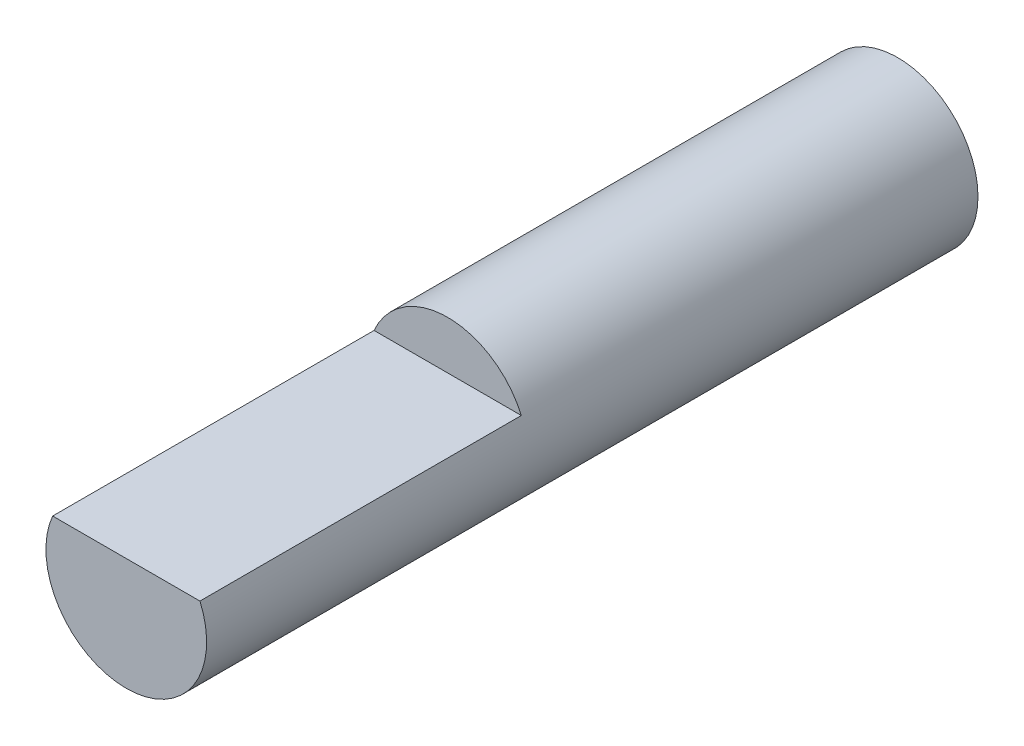
ISO-10303-21;
HEADER;
FILE_DESCRIPTION(('STEP AP214'),'2;1');
FILE_NAME('part.step','',(''),(''),'','','');
FILE_SCHEMA(('AUTOMOTIVE_DESIGN { 1 0 10303 214 1 1 1 1 }'));
ENDSEC;
DATA;
#1=APPLICATION_CONTEXT('core data for automotive mechanical design processes');
#2=APPLICATION_PROTOCOL_DEFINITION('international standard','automotive_design',2000,#1);
#3=PRODUCT_CONTEXT('',#1,'mechanical');
#4=PRODUCT('Part','Part','',(#3));
#5=PRODUCT_RELATED_PRODUCT_CATEGORY('part','',(#4));
#6=PRODUCT_DEFINITION_FORMATION('','',#4);
#7=PRODUCT_DEFINITION_CONTEXT('part definition',#1,'design');
#8=PRODUCT_DEFINITION('design','',#6,#7);
#9=PRODUCT_DEFINITION_SHAPE('','',#8);
#10=(LENGTH_UNIT() NAMED_UNIT(*) SI_UNIT(.MILLI.,.METRE.));
#11=(NAMED_UNIT(*) PLANE_ANGLE_UNIT() SI_UNIT($,.RADIAN.));
#12=(NAMED_UNIT(*) SI_UNIT($,.STERADIAN.) SOLID_ANGLE_UNIT());
#13=UNCERTAINTY_MEASURE_WITH_UNIT(LENGTH_MEASURE(1.E-05),#10,'distance_accuracy_value','');
#14=(GEOMETRIC_REPRESENTATION_CONTEXT(3) GLOBAL_UNCERTAINTY_ASSIGNED_CONTEXT((#13)) GLOBAL_UNIT_ASSIGNED_CONTEXT((#10,
#11,#12)) REPRESENTATION_CONTEXT('',''));
#15=CARTESIAN_POINT('',(0.,0.,0.));
#16=DIRECTION('',(0.,0.,1.));
#17=DIRECTION('',(1.,0.,0.));
#18=AXIS2_PLACEMENT_3D('',#15,#16,#17);
#19=CARTESIAN_POINT('',(0.,0.,24.));
#20=DIRECTION('',(0.,0.,-1.));
#21=DIRECTION('',(-1.,0.,0.));
#22=AXIS2_PLACEMENT_3D('',#19,#20,#21);
#23=CYLINDRICAL_SURFACE('',#22,2.5);
#24=CARTESIAN_POINT('',(0.,0.,24.));
#25=DIRECTION('',(0.,0.,1.));
#26=DIRECTION('',(1.,0.,0.));
#27=AXIS2_PLACEMENT_3D('',#24,#25,#26);
#28=CIRCLE('',#27,2.5);
#29=CARTESIAN_POINT('',(-2.29128784747792,1.,24.));
#30=VERTEX_POINT('',#29);
#31=CARTESIAN_POINT('',(2.29128784747792,1.,24.));
#32=VERTEX_POINT('',#31);
#33=EDGE_CURVE('E11',#30,#32,#28,.T.);
#34=ORIENTED_EDGE('',*,*,#33,.F.);
#35=DIRECTION('',(0.,0.,1.));
#36=VECTOR('',#35,1.);
#37=CARTESIAN_POINT('',(-2.29128784747792,1.,14.));
#38=LINE('',#37,#36);
#39=CARTESIAN_POINT('',(-2.29128784747792,1.,14.));
#40=VERTEX_POINT('',#39);
#41=EDGE_CURVE('E46',#40,#30,#38,.T.);
#42=ORIENTED_EDGE('',*,*,#41,.F.);
#43=CARTESIAN_POINT('',(0.,0.,14.));
#44=DIRECTION('',(0.,0.,1.));
#45=DIRECTION('',(1.,0.,0.));
#46=AXIS2_PLACEMENT_3D('',#43,#44,#45);
#47=CIRCLE('',#46,2.5);
#48=CARTESIAN_POINT('',(2.29128784747792,1.,14.));
#49=VERTEX_POINT('',#48);
#50=EDGE_CURVE('E61',#49,#40,#47,.T.);
#51=ORIENTED_EDGE('',*,*,#50,.F.);
#52=DIRECTION('',(0.,0.,1.));
#53=VECTOR('',#52,1.);
#54=CARTESIAN_POINT('',(2.29128784747792,1.,14.));
#55=LINE('',#54,#53);
#56=EDGE_CURVE('E52',#49,#32,#55,.T.);
#57=ORIENTED_EDGE('',*,*,#56,.T.);
#58=EDGE_LOOP('',(#34,#42,#51,#57));
#59=FACE_BOUND('',#58,.T.);
#60=CARTESIAN_POINT('',(0.,0.,0.));
#61=DIRECTION('',(0.,0.,1.));
#62=DIRECTION('',(1.,0.,0.));
#63=AXIS2_PLACEMENT_3D('',#60,#61,#62);
#64=CIRCLE('',#63,2.5);
#65=CARTESIAN_POINT('',(2.5,0.,0.));
#66=VERTEX_POINT('',#65);
#67=EDGE_CURVE('E35',#66,#66,#64,.T.);
#68=ORIENTED_EDGE('',*,*,#67,.T.);
#69=EDGE_LOOP('',(#68));
#70=FACE_BOUND('',#69,.T.);
#71=ADVANCED_FACE('F32',(#59,#70),#23,.T.);
#72=CARTESIAN_POINT('',(0.,0.,24.));
#73=DIRECTION('',(0.,0.,1.));
#74=DIRECTION('',(1.,0.,0.));
#75=AXIS2_PLACEMENT_3D('',#72,#73,#74);
#76=PLANE('',#75);
#77=DIRECTION('',(1.,0.,0.));
#78=VECTOR('',#77,1.);
#79=CARTESIAN_POINT('',(-2.29128784747792,1.,24.));
#80=LINE('',#79,#78);
#81=EDGE_CURVE('E57',#30,#32,#80,.T.);
#82=ORIENTED_EDGE('',*,*,#81,.F.);
#83=ORIENTED_EDGE('',*,*,#33,.T.);
#84=EDGE_LOOP('',(#82,#83));
#85=FACE_BOUND('',#84,.T.);
#86=ADVANCED_FACE('F67',(#85),#76,.T.);
#87=CARTESIAN_POINT('',(0.,0.,0.));
#88=DIRECTION('',(0.,0.,1.));
#89=DIRECTION('',(1.,0.,0.));
#90=AXIS2_PLACEMENT_3D('',#87,#88,#89);
#91=PLANE('',#90);
#92=ORIENTED_EDGE('',*,*,#67,.F.);
#93=EDGE_LOOP('',(#92));
#94=FACE_BOUND('',#93,.T.);
#95=ADVANCED_FACE('F69',(#94),#91,.F.);
#96=CARTESIAN_POINT('',(-2.29128784747792,1.,14.));
#97=DIRECTION('',(0.,-1.,0.));
#98=DIRECTION('',(0.,0.,-1.));
#99=AXIS2_PLACEMENT_3D('',#96,#97,#98);
#100=PLANE('',#99);
#101=ORIENTED_EDGE('',*,*,#81,.T.);
#102=ORIENTED_EDGE('',*,*,#56,.F.);
#103=DIRECTION('',(1.,0.,0.));
#104=VECTOR('',#103,1.);
#105=CARTESIAN_POINT('',(-2.29128784747792,1.,14.));
#106=LINE('',#105,#104);
#107=EDGE_CURVE('E84',#40,#49,#106,.T.);
#108=ORIENTED_EDGE('',*,*,#107,.F.);
#109=ORIENTED_EDGE('',*,*,#41,.T.);
#110=EDGE_LOOP('',(#101,#102,#108,#109));
#111=FACE_BOUND('',#110,.T.);
#112=ADVANCED_FACE('F58',(#111),#100,.F.);
#113=CARTESIAN_POINT('',(0.,0.,14.));
#114=DIRECTION('',(0.,0.,1.));
#115=DIRECTION('',(1.,0.,0.));
#116=AXIS2_PLACEMENT_3D('',#113,#114,#115);
#117=PLANE('',#116);
#118=ORIENTED_EDGE('',*,*,#50,.T.);
#119=ORIENTED_EDGE('',*,*,#107,.T.);
#120=EDGE_LOOP('',(#118,#119));
#121=FACE_BOUND('',#120,.T.);
#122=ADVANCED_FACE('F79',(#121),#117,.T.);
#123=CLOSED_SHELL('',(#71,#86,#95,#112,#122));
#124=MANIFOLD_SOLID_BREP('B2',#123);
#125=ADVANCED_BREP_SHAPE_REPRESENTATION('',(#18,#124),#14);
#126=SHAPE_DEFINITION_REPRESENTATION(#9,#125);
ENDSEC;
END-ISO-10303-21;
